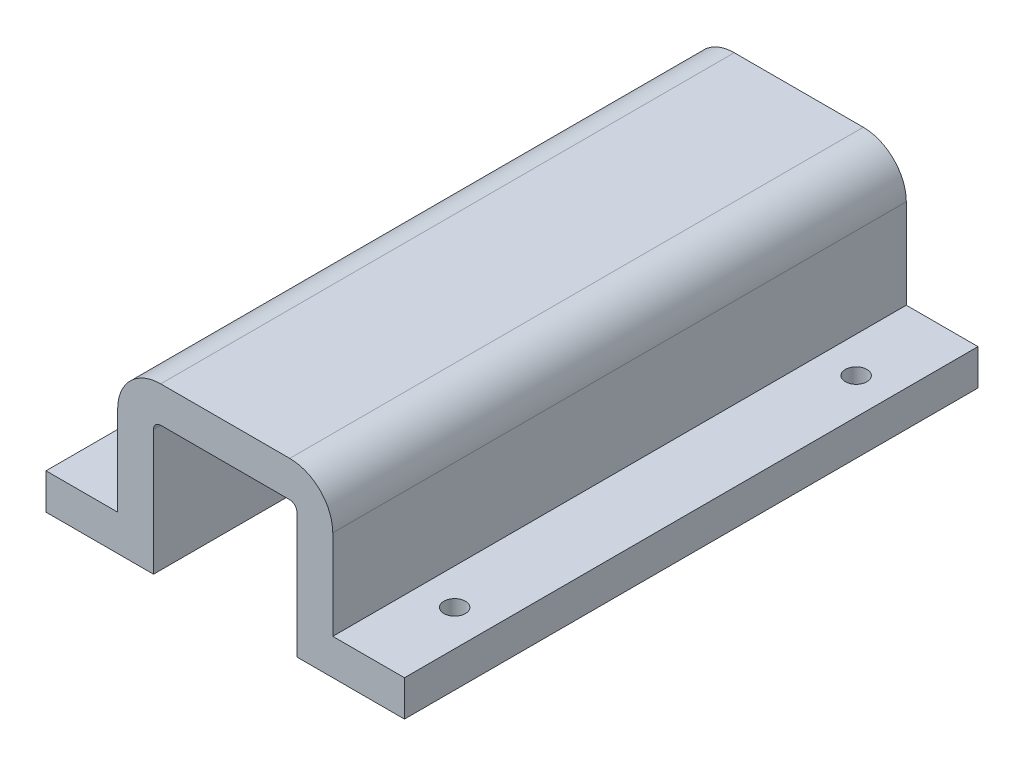
ISO-10303-21;
HEADER;
FILE_DESCRIPTION(('STEP AP214'),'2;1');
FILE_NAME('part.step','',(''),(''),'','','');
FILE_SCHEMA(('AUTOMOTIVE_DESIGN { 1 0 10303 214 1 1 1 1 }'));
ENDSEC;
DATA;
#1=APPLICATION_CONTEXT('core data for automotive mechanical design processes');
#2=APPLICATION_PROTOCOL_DEFINITION('international standard','automotive_design',2000,#1);
#3=PRODUCT_CONTEXT('',#1,'mechanical');
#4=PRODUCT('Part','Part','',(#3));
#5=PRODUCT_RELATED_PRODUCT_CATEGORY('part','',(#4));
#6=PRODUCT_DEFINITION_FORMATION('','',#4);
#7=PRODUCT_DEFINITION_CONTEXT('part definition',#1,'design');
#8=PRODUCT_DEFINITION('design','',#6,#7);
#9=PRODUCT_DEFINITION_SHAPE('','',#8);
#10=(LENGTH_UNIT() NAMED_UNIT(*) SI_UNIT(.MILLI.,.METRE.));
#11=(NAMED_UNIT(*) PLANE_ANGLE_UNIT() SI_UNIT($,.RADIAN.));
#12=(NAMED_UNIT(*) SI_UNIT($,.STERADIAN.) SOLID_ANGLE_UNIT());
#13=UNCERTAINTY_MEASURE_WITH_UNIT(LENGTH_MEASURE(1.E-05),#10,'distance_accuracy_value','');
#14=(GEOMETRIC_REPRESENTATION_CONTEXT(3) GLOBAL_UNCERTAINTY_ASSIGNED_CONTEXT((#13)) GLOBAL_UNIT_ASSIGNED_CONTEXT((#10,
#11,#12)) REPRESENTATION_CONTEXT('',''));
#15=CARTESIAN_POINT('',(0.,0.,0.));
#16=DIRECTION('',(0.,0.,1.));
#17=DIRECTION('',(1.,0.,0.));
#18=AXIS2_PLACEMENT_3D('',#15,#16,#17);
#19=CARTESIAN_POINT('',(9.,9.,80.));
#20=DIRECTION('',(0.,0.,-1.));
#21=DIRECTION('',(-1.,0.,0.));
#22=AXIS2_PLACEMENT_3D('',#19,#20,#21);
#23=CYLINDRICAL_SURFACE('',#22,6.);
#24=CARTESIAN_POINT('',(9.,9.,0.));
#25=DIRECTION('',(0.,0.,1.));
#26=DIRECTION('',(1.,0.,0.));
#27=AXIS2_PLACEMENT_3D('',#24,#25,#26);
#28=CIRCLE('',#27,6.);
#29=CARTESIAN_POINT('',(15.,8.99999999999999,0.));
#30=VERTEX_POINT('',#29);
#31=CARTESIAN_POINT('',(8.99999999999999,15.,0.));
#32=VERTEX_POINT('',#31);
#33=EDGE_CURVE('E182',#30,#32,#28,.T.);
#34=ORIENTED_EDGE('',*,*,#33,.T.);
#35=DIRECTION('',(0.,0.,-1.));
#36=VECTOR('',#35,1.);
#37=CARTESIAN_POINT('',(8.99999999999999,15.,80.));
#38=LINE('',#37,#36);
#39=CARTESIAN_POINT('',(8.99999999999999,15.,80.));
#40=VERTEX_POINT('',#39);
#41=EDGE_CURVE('E11',#40,#32,#38,.T.);
#42=ORIENTED_EDGE('',*,*,#41,.F.);
#43=CARTESIAN_POINT('',(9.,9.,80.));
#44=DIRECTION('',(0.,0.,1.));
#45=DIRECTION('',(1.,0.,0.));
#46=AXIS2_PLACEMENT_3D('',#43,#44,#45);
#47=CIRCLE('',#46,6.);
#48=CARTESIAN_POINT('',(15.,8.99999999999999,80.));
#49=VERTEX_POINT('',#48);
#50=EDGE_CURVE('E213',#49,#40,#47,.T.);
#51=ORIENTED_EDGE('',*,*,#50,.F.);
#52=DIRECTION('',(0.,0.,-1.));
#53=VECTOR('',#52,1.);
#54=CARTESIAN_POINT('',(15.,8.99999999999999,80.));
#55=LINE('',#54,#53);
#56=EDGE_CURVE('E178',#49,#30,#55,.T.);
#57=ORIENTED_EDGE('',*,*,#56,.T.);
#58=EDGE_LOOP('',(#34,#42,#51,#57));
#59=FACE_BOUND('',#58,.T.);
#60=ADVANCED_FACE('F38',(#59),#23,.T.);
#61=CARTESIAN_POINT('',(8.99999999999999,15.,80.));
#62=DIRECTION('',(0.,-1.,0.));
#63=DIRECTION('',(0.,0.,-1.));
#64=AXIS2_PLACEMENT_3D('',#61,#62,#63);
#65=PLANE('',#64);
#66=DIRECTION('',(-1.,0.,0.));
#67=VECTOR('',#66,1.);
#68=CARTESIAN_POINT('',(8.99999999999999,15.,0.));
#69=LINE('',#68,#67);
#70=CARTESIAN_POINT('',(-8.99999999999999,15.,0.));
#71=VERTEX_POINT('',#70);
#72=EDGE_CURVE('E185',#32,#71,#69,.T.);
#73=ORIENTED_EDGE('',*,*,#72,.T.);
#74=DIRECTION('',(0.,0.,-1.));
#75=VECTOR('',#74,1.);
#76=CARTESIAN_POINT('',(-8.99999999999999,15.,80.));
#77=LINE('',#76,#75);
#78=CARTESIAN_POINT('',(-8.99999999999999,15.,80.));
#79=VERTEX_POINT('',#78);
#80=EDGE_CURVE('E46',#79,#71,#77,.T.);
#81=ORIENTED_EDGE('',*,*,#80,.F.);
#82=DIRECTION('',(-1.,0.,0.));
#83=VECTOR('',#82,1.);
#84=CARTESIAN_POINT('',(8.99999999999999,15.,80.));
#85=LINE('',#84,#83);
#86=EDGE_CURVE('E121',#40,#79,#85,.T.);
#87=ORIENTED_EDGE('',*,*,#86,.F.);
#88=ORIENTED_EDGE('',*,*,#41,.T.);
#89=EDGE_LOOP('',(#73,#81,#87,#88));
#90=FACE_BOUND('',#89,.T.);
#91=ADVANCED_FACE('F312',(#90),#65,.F.);
#92=CARTESIAN_POINT('',(-9.,9.,80.));
#93=DIRECTION('',(0.,0.,-1.));
#94=DIRECTION('',(-1.,0.,0.));
#95=AXIS2_PLACEMENT_3D('',#92,#93,#94);
#96=CYLINDRICAL_SURFACE('',#95,6.);
#97=CARTESIAN_POINT('',(-9.,9.,0.));
#98=DIRECTION('',(0.,0.,1.));
#99=DIRECTION('',(1.,0.,0.));
#100=AXIS2_PLACEMENT_3D('',#97,#98,#99);
#101=CIRCLE('',#100,6.);
#102=CARTESIAN_POINT('',(-15.,8.99999999999995,0.));
#103=VERTEX_POINT('',#102);
#104=EDGE_CURVE('E188',#71,#103,#101,.T.);
#105=ORIENTED_EDGE('',*,*,#104,.T.);
#106=DIRECTION('',(0.,0.,-1.));
#107=VECTOR('',#106,1.);
#108=CARTESIAN_POINT('',(-15.,8.99999999999995,80.));
#109=LINE('',#108,#107);
#110=CARTESIAN_POINT('',(-15.,8.99999999999995,80.));
#111=VERTEX_POINT('',#110);
#112=EDGE_CURVE('E244',#111,#103,#109,.T.);
#113=ORIENTED_EDGE('',*,*,#112,.F.);
#114=CARTESIAN_POINT('',(-9.,9.,80.));
#115=DIRECTION('',(0.,0.,1.));
#116=DIRECTION('',(1.,0.,0.));
#117=AXIS2_PLACEMENT_3D('',#114,#115,#116);
#118=CIRCLE('',#117,6.);
#119=EDGE_CURVE('E252',#79,#111,#118,.T.);
#120=ORIENTED_EDGE('',*,*,#119,.F.);
#121=ORIENTED_EDGE('',*,*,#80,.T.);
#122=EDGE_LOOP('',(#105,#113,#120,#121));
#123=FACE_BOUND('',#122,.T.);
#124=ADVANCED_FACE('F250',(#123),#96,.T.);
#125=CARTESIAN_POINT('',(-15.,8.99999999999995,80.));
#126=DIRECTION('',(1.,0.,0.));
#127=DIRECTION('',(0.,1.,0.));
#128=AXIS2_PLACEMENT_3D('',#125,#126,#127);
#129=PLANE('',#128);
#130=DIRECTION('',(0.,-1.,0.));
#131=VECTOR('',#130,1.);
#132=CARTESIAN_POINT('',(-15.,8.99999999999995,0.));
#133=LINE('',#132,#131);
#134=CARTESIAN_POINT('',(-15.,-3.5,0.));
#135=VERTEX_POINT('',#134);
#136=EDGE_CURVE('E190',#103,#135,#133,.T.);
#137=ORIENTED_EDGE('',*,*,#136,.T.);
#138=DIRECTION('',(0.,0.,-1.));
#139=VECTOR('',#138,1.);
#140=CARTESIAN_POINT('',(-15.,-3.5,80.));
#141=LINE('',#140,#139);
#142=CARTESIAN_POINT('',(-15.,-3.5,80.));
#143=VERTEX_POINT('',#142);
#144=EDGE_CURVE('E241',#143,#135,#141,.T.);
#145=ORIENTED_EDGE('',*,*,#144,.F.);
#146=DIRECTION('',(0.,-1.,0.));
#147=VECTOR('',#146,1.);
#148=CARTESIAN_POINT('',(-15.,8.99999999999995,80.));
#149=LINE('',#148,#147);
#150=EDGE_CURVE('E270',#111,#143,#149,.T.);
#151=ORIENTED_EDGE('',*,*,#150,.F.);
#152=ORIENTED_EDGE('',*,*,#112,.T.);
#153=EDGE_LOOP('',(#137,#145,#151,#152));
#154=FACE_BOUND('',#153,.T.);
#155=ADVANCED_FACE('F261',(#154),#129,.F.);
#156=CARTESIAN_POINT('',(-15.,-3.5,80.));
#157=DIRECTION('',(0.,-1.,0.));
#158=DIRECTION('',(1.,0.,0.));
#159=AXIS2_PLACEMENT_3D('',#156,#157,#158);
#160=PLANE('',#159);
#161=CARTESIAN_POINT('',(-20.,-3.5,12.));
#162=DIRECTION('',(0.,1.,0.));
#163=DIRECTION('',(0.,0.,1.));
#164=AXIS2_PLACEMENT_3D('',#161,#162,#163);
#165=CIRCLE('',#164,1.5);
#166=CARTESIAN_POINT('',(-20.,-3.5,13.5));
#167=VERTEX_POINT('',#166);
#168=EDGE_CURVE('E527',#167,#167,#165,.T.);
#169=ORIENTED_EDGE('',*,*,#168,.F.);
#170=EDGE_LOOP('',(#169));
#171=FACE_BOUND('',#170,.T.);
#172=CARTESIAN_POINT('',(-20.,-3.5,68.));
#173=DIRECTION('',(0.,1.,0.));
#174=DIRECTION('',(0.,0.,1.));
#175=AXIS2_PLACEMENT_3D('',#172,#173,#174);
#176=CIRCLE('',#175,1.5);
#177=CARTESIAN_POINT('',(-20.,-3.5,69.5));
#178=VERTEX_POINT('',#177);
#179=EDGE_CURVE('E529',#178,#178,#176,.T.);
#180=ORIENTED_EDGE('',*,*,#179,.F.);
#181=EDGE_LOOP('',(#180));
#182=FACE_BOUND('',#181,.T.);
#183=DIRECTION('',(-1.,0.,0.));
#184=VECTOR('',#183,1.);
#185=CARTESIAN_POINT('',(-15.,-3.5,0.));
#186=LINE('',#185,#184);
#187=CARTESIAN_POINT('',(-25.,-3.50000000000001,0.));
#188=VERTEX_POINT('',#187);
#189=EDGE_CURVE('E192',#135,#188,#186,.T.);
#190=ORIENTED_EDGE('',*,*,#189,.T.);
#191=DIRECTION('',(0.,0.,-1.));
#192=VECTOR('',#191,1.);
#193=CARTESIAN_POINT('',(-25.,-3.50000000000001,80.));
#194=LINE('',#193,#192);
#195=CARTESIAN_POINT('',(-25.,-3.50000000000001,80.));
#196=VERTEX_POINT('',#195);
#197=EDGE_CURVE('E238',#196,#188,#194,.T.);
#198=ORIENTED_EDGE('',*,*,#197,.F.);
#199=DIRECTION('',(-1.,0.,0.));
#200=VECTOR('',#199,1.);
#201=CARTESIAN_POINT('',(-15.,-3.5,80.));
#202=LINE('',#201,#200);
#203=EDGE_CURVE('E267',#143,#196,#202,.T.);
#204=ORIENTED_EDGE('',*,*,#203,.F.);
#205=ORIENTED_EDGE('',*,*,#144,.T.);
#206=EDGE_LOOP('',(#190,#198,#204,#205));
#207=FACE_BOUND('',#206,.T.);
#208=ADVANCED_FACE('F265',(#171,#182,#207),#160,.F.);
#209=CARTESIAN_POINT('',(-25.,-3.50000000000001,80.));
#210=DIRECTION('',(1.,0.,0.));
#211=DIRECTION('',(0.,0.,-1.));
#212=AXIS2_PLACEMENT_3D('',#209,#210,#211);
#213=PLANE('',#212);
#214=DIRECTION('',(0.,-1.,0.));
#215=VECTOR('',#214,1.);
#216=CARTESIAN_POINT('',(-25.,-3.50000000000001,0.));
#217=LINE('',#216,#215);
#218=CARTESIAN_POINT('',(-25.,-8.5,0.));
#219=VERTEX_POINT('',#218);
#220=EDGE_CURVE('E194',#188,#219,#217,.T.);
#221=ORIENTED_EDGE('',*,*,#220,.T.);
#222=DIRECTION('',(0.,0.,-1.));
#223=VECTOR('',#222,1.);
#224=CARTESIAN_POINT('',(-25.,-8.5,80.));
#225=LINE('',#224,#223);
#226=CARTESIAN_POINT('',(-25.,-8.5,80.));
#227=VERTEX_POINT('',#226);
#228=EDGE_CURVE('E235',#227,#219,#225,.T.);
#229=ORIENTED_EDGE('',*,*,#228,.F.);
#230=DIRECTION('',(0.,-1.,0.));
#231=VECTOR('',#230,1.);
#232=CARTESIAN_POINT('',(-25.,-3.50000000000001,80.));
#233=LINE('',#232,#231);
#234=EDGE_CURVE('E269',#196,#227,#233,.T.);
#235=ORIENTED_EDGE('',*,*,#234,.F.);
#236=ORIENTED_EDGE('',*,*,#197,.T.);
#237=EDGE_LOOP('',(#221,#229,#235,#236));
#238=FACE_BOUND('',#237,.T.);
#239=ADVANCED_FACE('F325',(#238),#213,.F.);
#240=CARTESIAN_POINT('',(-25.,-8.5,80.));
#241=DIRECTION('',(0.,1.,0.));
#242=DIRECTION('',(-1.,0.,0.));
#243=AXIS2_PLACEMENT_3D('',#240,#241,#242);
#244=PLANE('',#243);
#245=CARTESIAN_POINT('',(-20.,-8.50000000000001,12.));
#246=DIRECTION('',(0.,1.,0.));
#247=DIRECTION('',(0.,0.,1.));
#248=AXIS2_PLACEMENT_3D('',#245,#246,#247);
#249=CIRCLE('',#248,1.5);
#250=CARTESIAN_POINT('',(-20.,-8.50000000000001,13.5));
#251=VERTEX_POINT('',#250);
#252=EDGE_CURVE('E524',#251,#251,#249,.T.);
#253=ORIENTED_EDGE('',*,*,#252,.T.);
#254=EDGE_LOOP('',(#253));
#255=FACE_BOUND('',#254,.T.);
#256=CARTESIAN_POINT('',(-20.,-8.50000000000001,68.));
#257=DIRECTION('',(0.,1.,0.));
#258=DIRECTION('',(0.,0.,1.));
#259=AXIS2_PLACEMENT_3D('',#256,#257,#258);
#260=CIRCLE('',#259,1.5);
#261=CARTESIAN_POINT('',(-20.,-8.50000000000001,69.5));
#262=VERTEX_POINT('',#261);
#263=EDGE_CURVE('E534',#262,#262,#260,.T.);
#264=ORIENTED_EDGE('',*,*,#263,.T.);
#265=EDGE_LOOP('',(#264));
#266=FACE_BOUND('',#265,.T.);
#267=DIRECTION('',(1.,0.,0.));
#268=VECTOR('',#267,1.);
#269=CARTESIAN_POINT('',(-25.,-8.5,0.));
#270=LINE('',#269,#268);
#271=CARTESIAN_POINT('',(-10.,-8.5,0.));
#272=VERTEX_POINT('',#271);
#273=EDGE_CURVE('E196',#219,#272,#270,.T.);
#274=ORIENTED_EDGE('',*,*,#273,.T.);
#275=DIRECTION('',(0.,0.,-1.));
#276=VECTOR('',#275,1.);
#277=CARTESIAN_POINT('',(-10.,-8.5,80.));
#278=LINE('',#277,#276);
#279=CARTESIAN_POINT('',(-10.,-8.5,80.));
#280=VERTEX_POINT('',#279);
#281=EDGE_CURVE('E232',#280,#272,#278,.T.);
#282=ORIENTED_EDGE('',*,*,#281,.F.);
#283=DIRECTION('',(1.,0.,0.));
#284=VECTOR('',#283,1.);
#285=CARTESIAN_POINT('',(-25.,-8.5,80.));
#286=LINE('',#285,#284);
#287=EDGE_CURVE('E272',#227,#280,#286,.T.);
#288=ORIENTED_EDGE('',*,*,#287,.F.);
#289=ORIENTED_EDGE('',*,*,#228,.T.);
#290=EDGE_LOOP('',(#274,#282,#288,#289));
#291=FACE_BOUND('',#290,.T.);
#292=ADVANCED_FACE('F329',(#255,#266,#291),#244,.F.);
#293=CARTESIAN_POINT('',(-10.,8.99999999999999,80.));
#294=DIRECTION('',(-1.,0.,0.));
#295=DIRECTION('',(0.,-1.,0.));
#296=AXIS2_PLACEMENT_3D('',#293,#294,#295);
#297=PLANE('',#296);
#298=DIRECTION('',(0.,1.,0.));
#299=VECTOR('',#298,1.);
#300=CARTESIAN_POINT('',(-10.,8.99999999999999,0.));
#301=LINE('',#300,#299);
#302=CARTESIAN_POINT('',(-10.,8.99999999999999,0.));
#303=VERTEX_POINT('',#302);
#304=EDGE_CURVE('E198',#272,#303,#301,.T.);
#305=ORIENTED_EDGE('',*,*,#304,.T.);
#306=DIRECTION('',(0.,0.,-1.));
#307=VECTOR('',#306,1.);
#308=CARTESIAN_POINT('',(-10.,8.99999999999999,80.));
#309=LINE('',#308,#307);
#310=CARTESIAN_POINT('',(-10.,8.99999999999999,80.));
#311=VERTEX_POINT('',#310);
#312=EDGE_CURVE('E229',#311,#303,#309,.T.);
#313=ORIENTED_EDGE('',*,*,#312,.F.);
#314=DIRECTION('',(0.,1.,0.));
#315=VECTOR('',#314,1.);
#316=CARTESIAN_POINT('',(-10.,8.99999999999999,80.));
#317=LINE('',#316,#315);
#318=EDGE_CURVE('E278',#280,#311,#317,.T.);
#319=ORIENTED_EDGE('',*,*,#318,.F.);
#320=ORIENTED_EDGE('',*,*,#281,.T.);
#321=EDGE_LOOP('',(#305,#313,#319,#320));
#322=FACE_BOUND('',#321,.T.);
#323=ADVANCED_FACE('F333',(#322),#297,.F.);
#324=CARTESIAN_POINT('',(-9.,9.,80.));
#325=DIRECTION('',(0.,0.,-1.));
#326=DIRECTION('',(-1.,0.,0.));
#327=AXIS2_PLACEMENT_3D('',#324,#325,#326);
#328=CYLINDRICAL_SURFACE('',#327,0.999999999999999);
#329=CARTESIAN_POINT('',(-9.,9.,0.));
#330=DIRECTION('',(0.,0.,-1.));
#331=DIRECTION('',(1.,0.,0.));
#332=AXIS2_PLACEMENT_3D('',#329,#330,#331);
#333=CIRCLE('',#332,0.999999999999999);
#334=CARTESIAN_POINT('',(-8.99999999999999,10.,0.));
#335=VERTEX_POINT('',#334);
#336=EDGE_CURVE('E200',#303,#335,#333,.T.);
#337=ORIENTED_EDGE('',*,*,#336,.T.);
#338=DIRECTION('',(0.,0.,-1.));
#339=VECTOR('',#338,1.);
#340=CARTESIAN_POINT('',(-8.99999999999999,10.,80.));
#341=LINE('',#340,#339);
#342=CARTESIAN_POINT('',(-8.99999999999999,10.,80.));
#343=VERTEX_POINT('',#342);
#344=EDGE_CURVE('E226',#343,#335,#341,.T.);
#345=ORIENTED_EDGE('',*,*,#344,.F.);
#346=CARTESIAN_POINT('',(-9.,9.,80.));
#347=DIRECTION('',(0.,0.,-1.));
#348=DIRECTION('',(1.,0.,0.));
#349=AXIS2_PLACEMENT_3D('',#346,#347,#348);
#350=CIRCLE('',#349,0.999999999999999);
#351=EDGE_CURVE('E280',#311,#343,#350,.T.);
#352=ORIENTED_EDGE('',*,*,#351,.F.);
#353=ORIENTED_EDGE('',*,*,#312,.T.);
#354=EDGE_LOOP('',(#337,#345,#352,#353));
#355=FACE_BOUND('',#354,.T.);
#356=ADVANCED_FACE('F337',(#355),#328,.F.);
#357=CARTESIAN_POINT('',(8.99999999999999,10.,80.));
#358=DIRECTION('',(0.,1.,0.));
#359=DIRECTION('',(-1.,0.,0.));
#360=AXIS2_PLACEMENT_3D('',#357,#358,#359);
#361=PLANE('',#360);
#362=DIRECTION('',(1.,0.,0.));
#363=VECTOR('',#362,1.);
#364=CARTESIAN_POINT('',(8.99999999999999,10.,0.));
#365=LINE('',#364,#363);
#366=CARTESIAN_POINT('',(8.99999999999999,10.,0.));
#367=VERTEX_POINT('',#366);
#368=EDGE_CURVE('E202',#335,#367,#365,.T.);
#369=ORIENTED_EDGE('',*,*,#368,.T.);
#370=DIRECTION('',(0.,0.,-1.));
#371=VECTOR('',#370,1.);
#372=CARTESIAN_POINT('',(8.99999999999999,10.,80.));
#373=LINE('',#372,#371);
#374=CARTESIAN_POINT('',(8.99999999999999,10.,80.));
#375=VERTEX_POINT('',#374);
#376=EDGE_CURVE('E223',#375,#367,#373,.T.);
#377=ORIENTED_EDGE('',*,*,#376,.F.);
#378=DIRECTION('',(1.,0.,0.));
#379=VECTOR('',#378,1.);
#380=CARTESIAN_POINT('',(8.99999999999999,10.,80.));
#381=LINE('',#380,#379);
#382=EDGE_CURVE('E282',#343,#375,#381,.T.);
#383=ORIENTED_EDGE('',*,*,#382,.F.);
#384=ORIENTED_EDGE('',*,*,#344,.T.);
#385=EDGE_LOOP('',(#369,#377,#383,#384));
#386=FACE_BOUND('',#385,.T.);
#387=ADVANCED_FACE('F341',(#386),#361,.F.);
#388=CARTESIAN_POINT('',(9.,9.,80.));
#389=DIRECTION('',(0.,0.,-1.));
#390=DIRECTION('',(-1.,0.,0.));
#391=AXIS2_PLACEMENT_3D('',#388,#389,#390);
#392=CYLINDRICAL_SURFACE('',#391,0.999999999999999);
#393=CARTESIAN_POINT('',(9.,9.,0.));
#394=DIRECTION('',(0.,0.,-1.));
#395=DIRECTION('',(1.,0.,0.));
#396=AXIS2_PLACEMENT_3D('',#393,#394,#395);
#397=CIRCLE('',#396,0.999999999999999);
#398=CARTESIAN_POINT('',(10.,8.99999999999999,0.));
#399=VERTEX_POINT('',#398);
#400=EDGE_CURVE('E204',#367,#399,#397,.T.);
#401=ORIENTED_EDGE('',*,*,#400,.T.);
#402=DIRECTION('',(0.,0.,-1.));
#403=VECTOR('',#402,1.);
#404=CARTESIAN_POINT('',(10.,8.99999999999999,80.));
#405=LINE('',#404,#403);
#406=CARTESIAN_POINT('',(10.,8.99999999999999,80.));
#407=VERTEX_POINT('',#406);
#408=EDGE_CURVE('E220',#407,#399,#405,.T.);
#409=ORIENTED_EDGE('',*,*,#408,.F.);
#410=CARTESIAN_POINT('',(9.,9.,80.));
#411=DIRECTION('',(0.,0.,-1.));
#412=DIRECTION('',(1.,0.,0.));
#413=AXIS2_PLACEMENT_3D('',#410,#411,#412);
#414=CIRCLE('',#413,0.999999999999999);
#415=EDGE_CURVE('E284',#375,#407,#414,.T.);
#416=ORIENTED_EDGE('',*,*,#415,.F.);
#417=ORIENTED_EDGE('',*,*,#376,.T.);
#418=EDGE_LOOP('',(#401,#409,#416,#417));
#419=FACE_BOUND('',#418,.T.);
#420=ADVANCED_FACE('F345',(#419),#392,.F.);
#421=CARTESIAN_POINT('',(10.,8.99999999999999,80.));
#422=DIRECTION('',(1.,0.,0.));
#423=DIRECTION('',(0.,0.,-1.));
#424=AXIS2_PLACEMENT_3D('',#421,#422,#423);
#425=PLANE('',#424);
#426=DIRECTION('',(0.,-1.,0.));
#427=VECTOR('',#426,1.);
#428=CARTESIAN_POINT('',(10.,8.99999999999999,0.));
#429=LINE('',#428,#427);
#430=CARTESIAN_POINT('',(10.,-8.5,0.));
#431=VERTEX_POINT('',#430);
#432=EDGE_CURVE('E206',#399,#431,#429,.T.);
#433=ORIENTED_EDGE('',*,*,#432,.T.);
#434=DIRECTION('',(0.,0.,-1.));
#435=VECTOR('',#434,1.);
#436=CARTESIAN_POINT('',(10.,-8.5,80.));
#437=LINE('',#436,#435);
#438=CARTESIAN_POINT('',(10.,-8.5,80.));
#439=VERTEX_POINT('',#438);
#440=EDGE_CURVE('E217',#439,#431,#437,.T.);
#441=ORIENTED_EDGE('',*,*,#440,.F.);
#442=DIRECTION('',(0.,-1.,0.));
#443=VECTOR('',#442,1.);
#444=CARTESIAN_POINT('',(10.,8.99999999999999,80.));
#445=LINE('',#444,#443);
#446=EDGE_CURVE('E286',#407,#439,#445,.T.);
#447=ORIENTED_EDGE('',*,*,#446,.F.);
#448=ORIENTED_EDGE('',*,*,#408,.T.);
#449=EDGE_LOOP('',(#433,#441,#447,#448));
#450=FACE_BOUND('',#449,.T.);
#451=ADVANCED_FACE('F292',(#450),#425,.F.);
#452=CARTESIAN_POINT('',(10.,-8.5,80.));
#453=DIRECTION('',(0.,1.,0.));
#454=DIRECTION('',(-1.,0.,0.));
#455=AXIS2_PLACEMENT_3D('',#452,#453,#454);
#456=PLANE('',#455);
#457=CARTESIAN_POINT('',(20.,-8.5,12.));
#458=DIRECTION('',(0.,1.,0.));
#459=DIRECTION('',(0.,0.,1.));
#460=AXIS2_PLACEMENT_3D('',#457,#458,#459);
#461=CIRCLE('',#460,1.5);
#462=CARTESIAN_POINT('',(20.,-8.5,13.5));
#463=VERTEX_POINT('',#462);
#464=EDGE_CURVE('E540',#463,#463,#461,.T.);
#465=ORIENTED_EDGE('',*,*,#464,.T.);
#466=EDGE_LOOP('',(#465));
#467=FACE_BOUND('',#466,.T.);
#468=CARTESIAN_POINT('',(20.,-8.5,68.));
#469=DIRECTION('',(0.,1.,0.));
#470=DIRECTION('',(0.,0.,1.));
#471=AXIS2_PLACEMENT_3D('',#468,#469,#470);
#472=CIRCLE('',#471,1.5);
#473=CARTESIAN_POINT('',(20.,-8.5,69.5));
#474=VERTEX_POINT('',#473);
#475=EDGE_CURVE('E186',#474,#474,#472,.T.);
#476=ORIENTED_EDGE('',*,*,#475,.T.);
#477=EDGE_LOOP('',(#476));
#478=FACE_BOUND('',#477,.T.);
#479=DIRECTION('',(1.,0.,0.));
#480=VECTOR('',#479,1.);
#481=CARTESIAN_POINT('',(10.,-8.5,0.));
#482=LINE('',#481,#480);
#483=CARTESIAN_POINT('',(25.,-8.5,0.));
#484=VERTEX_POINT('',#483);
#485=EDGE_CURVE('E208',#431,#484,#482,.T.);
#486=ORIENTED_EDGE('',*,*,#485,.T.);
#487=DIRECTION('',(0.,0.,-1.));
#488=VECTOR('',#487,1.);
#489=CARTESIAN_POINT('',(25.,-8.5,80.));
#490=LINE('',#489,#488);
#491=CARTESIAN_POINT('',(25.,-8.5,80.));
#492=VERTEX_POINT('',#491);
#493=EDGE_CURVE('E173',#492,#484,#490,.T.);
#494=ORIENTED_EDGE('',*,*,#493,.F.);
#495=DIRECTION('',(1.,0.,0.));
#496=VECTOR('',#495,1.);
#497=CARTESIAN_POINT('',(10.,-8.5,80.));
#498=LINE('',#497,#496);
#499=EDGE_CURVE('E164',#439,#492,#498,.T.);
#500=ORIENTED_EDGE('',*,*,#499,.F.);
#501=ORIENTED_EDGE('',*,*,#440,.T.);
#502=EDGE_LOOP('',(#486,#494,#500,#501));
#503=FACE_BOUND('',#502,.T.);
#504=ADVANCED_FACE('F296',(#467,#478,#503),#456,.F.);
#505=CARTESIAN_POINT('',(25.,-8.5,80.));
#506=DIRECTION('',(-1.,0.,0.));
#507=DIRECTION('',(0.,-1.,0.));
#508=AXIS2_PLACEMENT_3D('',#505,#506,#507);
#509=PLANE('',#508);
#510=DIRECTION('',(0.,1.,0.));
#511=VECTOR('',#510,1.);
#512=CARTESIAN_POINT('',(25.,-8.5,0.));
#513=LINE('',#512,#511);
#514=CARTESIAN_POINT('',(25.,-3.5,0.));
#515=VERTEX_POINT('',#514);
#516=EDGE_CURVE('E172',#484,#515,#513,.T.);
#517=ORIENTED_EDGE('',*,*,#516,.T.);
#518=DIRECTION('',(0.,0.,-1.));
#519=VECTOR('',#518,1.);
#520=CARTESIAN_POINT('',(25.,-3.5,80.));
#521=LINE('',#520,#519);
#522=CARTESIAN_POINT('',(25.,-3.5,80.));
#523=VERTEX_POINT('',#522);
#524=EDGE_CURVE('E169',#523,#515,#521,.T.);
#525=ORIENTED_EDGE('',*,*,#524,.F.);
#526=DIRECTION('',(0.,1.,0.));
#527=VECTOR('',#526,1.);
#528=CARTESIAN_POINT('',(25.,-8.5,80.));
#529=LINE('',#528,#527);
#530=EDGE_CURVE('E158',#492,#523,#529,.T.);
#531=ORIENTED_EDGE('',*,*,#530,.F.);
#532=ORIENTED_EDGE('',*,*,#493,.T.);
#533=EDGE_LOOP('',(#517,#525,#531,#532));
#534=FACE_BOUND('',#533,.T.);
#535=ADVANCED_FACE('F170',(#534),#509,.F.);
#536=CARTESIAN_POINT('',(25.,-3.5,80.));
#537=DIRECTION('',(0.,-1.,0.));
#538=DIRECTION('',(1.,0.,0.));
#539=AXIS2_PLACEMENT_3D('',#536,#537,#538);
#540=PLANE('',#539);
#541=CARTESIAN_POINT('',(20.,-3.5,12.));
#542=DIRECTION('',(0.,1.,0.));
#543=DIRECTION('',(0.,0.,1.));
#544=AXIS2_PLACEMENT_3D('',#541,#542,#543);
#545=CIRCLE('',#544,1.5);
#546=CARTESIAN_POINT('',(20.,-3.5,13.5));
#547=VERTEX_POINT('',#546);
#548=EDGE_CURVE('E537',#547,#547,#545,.T.);
#549=ORIENTED_EDGE('',*,*,#548,.F.);
#550=EDGE_LOOP('',(#549));
#551=FACE_BOUND('',#550,.T.);
#552=CARTESIAN_POINT('',(20.,-3.5,68.));
#553=DIRECTION('',(0.,1.,0.));
#554=DIRECTION('',(0.,0.,1.));
#555=AXIS2_PLACEMENT_3D('',#552,#553,#554);
#556=CIRCLE('',#555,1.5);
#557=CARTESIAN_POINT('',(20.,-3.5,69.5));
#558=VERTEX_POINT('',#557);
#559=EDGE_CURVE('E543',#558,#558,#556,.T.);
#560=ORIENTED_EDGE('',*,*,#559,.F.);
#561=EDGE_LOOP('',(#560));
#562=FACE_BOUND('',#561,.T.);
#563=DIRECTION('',(-1.,0.,0.));
#564=VECTOR('',#563,1.);
#565=CARTESIAN_POINT('',(25.,-3.5,0.));
#566=LINE('',#565,#564);
#567=CARTESIAN_POINT('',(15.,-3.5,0.));
#568=VERTEX_POINT('',#567);
#569=EDGE_CURVE('E107',#515,#568,#566,.T.);
#570=ORIENTED_EDGE('',*,*,#569,.T.);
#571=DIRECTION('',(0.,0.,-1.));
#572=VECTOR('',#571,1.);
#573=CARTESIAN_POINT('',(15.,-3.5,80.));
#574=LINE('',#573,#572);
#575=CARTESIAN_POINT('',(15.,-3.5,80.));
#576=VERTEX_POINT('',#575);
#577=EDGE_CURVE('E174',#576,#568,#574,.T.);
#578=ORIENTED_EDGE('',*,*,#577,.F.);
#579=DIRECTION('',(-1.,0.,0.));
#580=VECTOR('',#579,1.);
#581=CARTESIAN_POINT('',(25.,-3.5,80.));
#582=LINE('',#581,#580);
#583=EDGE_CURVE('E162',#523,#576,#582,.T.);
#584=ORIENTED_EDGE('',*,*,#583,.F.);
#585=ORIENTED_EDGE('',*,*,#524,.T.);
#586=EDGE_LOOP('',(#570,#578,#584,#585));
#587=FACE_BOUND('',#586,.T.);
#588=ADVANCED_FACE('F176',(#551,#562,#587),#540,.F.);
#589=CARTESIAN_POINT('',(15.,-3.5,80.));
#590=DIRECTION('',(-1.,0.,0.));
#591=DIRECTION('',(0.,-1.,0.));
#592=AXIS2_PLACEMENT_3D('',#589,#590,#591);
#593=PLANE('',#592);
#594=DIRECTION('',(0.,1.,0.));
#595=VECTOR('',#594,1.);
#596=CARTESIAN_POINT('',(15.,-3.5,0.));
#597=LINE('',#596,#595);
#598=EDGE_CURVE('E113',#568,#30,#597,.T.);
#599=ORIENTED_EDGE('',*,*,#598,.T.);
#600=ORIENTED_EDGE('',*,*,#56,.F.);
#601=DIRECTION('',(0.,1.,0.));
#602=VECTOR('',#601,1.);
#603=CARTESIAN_POINT('',(15.,-3.5,80.));
#604=LINE('',#603,#602);
#605=EDGE_CURVE('E54',#576,#49,#604,.T.);
#606=ORIENTED_EDGE('',*,*,#605,.F.);
#607=ORIENTED_EDGE('',*,*,#577,.T.);
#608=EDGE_LOOP('',(#599,#600,#606,#607));
#609=FACE_BOUND('',#608,.T.);
#610=ADVANCED_FACE('F300',(#609),#593,.F.);
#611=CARTESIAN_POINT('',(9.,9.,80.));
#612=DIRECTION('',(0.,0.,1.));
#613=DIRECTION('',(1.,0.,0.));
#614=AXIS2_PLACEMENT_3D('',#611,#612,#613);
#615=PLANE('',#614);
#616=ORIENTED_EDGE('',*,*,#50,.T.);
#617=ORIENTED_EDGE('',*,*,#86,.T.);
#618=ORIENTED_EDGE('',*,*,#119,.T.);
#619=ORIENTED_EDGE('',*,*,#150,.T.);
#620=ORIENTED_EDGE('',*,*,#203,.T.);
#621=ORIENTED_EDGE('',*,*,#234,.T.);
#622=ORIENTED_EDGE('',*,*,#287,.T.);
#623=ORIENTED_EDGE('',*,*,#318,.T.);
#624=ORIENTED_EDGE('',*,*,#351,.T.);
#625=ORIENTED_EDGE('',*,*,#382,.T.);
#626=ORIENTED_EDGE('',*,*,#415,.T.);
#627=ORIENTED_EDGE('',*,*,#446,.T.);
#628=ORIENTED_EDGE('',*,*,#499,.T.);
#629=ORIENTED_EDGE('',*,*,#530,.T.);
#630=ORIENTED_EDGE('',*,*,#583,.T.);
#631=ORIENTED_EDGE('',*,*,#605,.T.);
#632=EDGE_LOOP('',(#616,#617,#618,#619,#620,#621,#622,#623,#624,#625,#626,#627,#628,#629,#630,#631));
#633=FACE_BOUND('',#632,.T.);
#634=ADVANCED_FACE('F160',(#633),#615,.T.);
#635=CARTESIAN_POINT('',(9.,9.,0.));
#636=DIRECTION('',(0.,0.,1.));
#637=DIRECTION('',(1.,0.,0.));
#638=AXIS2_PLACEMENT_3D('',#635,#636,#637);
#639=PLANE('',#638);
#640=ORIENTED_EDGE('',*,*,#33,.F.);
#641=ORIENTED_EDGE('',*,*,#598,.F.);
#642=ORIENTED_EDGE('',*,*,#569,.F.);
#643=ORIENTED_EDGE('',*,*,#516,.F.);
#644=ORIENTED_EDGE('',*,*,#485,.F.);
#645=ORIENTED_EDGE('',*,*,#432,.F.);
#646=ORIENTED_EDGE('',*,*,#400,.F.);
#647=ORIENTED_EDGE('',*,*,#368,.F.);
#648=ORIENTED_EDGE('',*,*,#336,.F.);
#649=ORIENTED_EDGE('',*,*,#304,.F.);
#650=ORIENTED_EDGE('',*,*,#273,.F.);
#651=ORIENTED_EDGE('',*,*,#220,.F.);
#652=ORIENTED_EDGE('',*,*,#189,.F.);
#653=ORIENTED_EDGE('',*,*,#136,.F.);
#654=ORIENTED_EDGE('',*,*,#104,.F.);
#655=ORIENTED_EDGE('',*,*,#72,.F.);
#656=EDGE_LOOP('',(#640,#641,#642,#643,#644,#645,#646,#647,#648,#649,#650,#651,#652,#653,#654,#655));
#657=FACE_BOUND('',#656,.T.);
#658=ADVANCED_FACE('F256',(#657),#639,.F.);
#659=CARTESIAN_POINT('',(20.,-3.5,68.));
#660=DIRECTION('',(0.,1.,0.));
#661=DIRECTION('',(0.,0.,1.));
#662=AXIS2_PLACEMENT_3D('',#659,#660,#661);
#663=CYLINDRICAL_SURFACE('',#662,1.5);
#664=ORIENTED_EDGE('',*,*,#475,.F.);
#665=EDGE_LOOP('',(#664));
#666=FACE_BOUND('',#665,.T.);
#667=ORIENTED_EDGE('',*,*,#559,.T.);
#668=EDGE_LOOP('',(#667));
#669=FACE_BOUND('',#668,.T.);
#670=ADVANCED_FACE('F374',(#666,#669),#663,.F.);
#671=CARTESIAN_POINT('',(20.,-3.5,12.));
#672=DIRECTION('',(0.,1.,0.));
#673=DIRECTION('',(0.,0.,1.));
#674=AXIS2_PLACEMENT_3D('',#671,#672,#673);
#675=CYLINDRICAL_SURFACE('',#674,1.5);
#676=ORIENTED_EDGE('',*,*,#464,.F.);
#677=EDGE_LOOP('',(#676));
#678=FACE_BOUND('',#677,.T.);
#679=ORIENTED_EDGE('',*,*,#548,.T.);
#680=EDGE_LOOP('',(#679));
#681=FACE_BOUND('',#680,.T.);
#682=ADVANCED_FACE('F379',(#678,#681),#675,.F.);
#683=CARTESIAN_POINT('',(-20.,-3.5,68.));
#684=DIRECTION('',(0.,1.,0.));
#685=DIRECTION('',(0.,0.,1.));
#686=AXIS2_PLACEMENT_3D('',#683,#684,#685);
#687=CYLINDRICAL_SURFACE('',#686,1.5);
#688=ORIENTED_EDGE('',*,*,#263,.F.);
#689=EDGE_LOOP('',(#688));
#690=FACE_BOUND('',#689,.T.);
#691=ORIENTED_EDGE('',*,*,#179,.T.);
#692=EDGE_LOOP('',(#691));
#693=FACE_BOUND('',#692,.T.);
#694=ADVANCED_FACE('F391',(#690,#693),#687,.F.);
#695=CARTESIAN_POINT('',(-20.,-3.5,12.));
#696=DIRECTION('',(0.,1.,0.));
#697=DIRECTION('',(0.,0.,1.));
#698=AXIS2_PLACEMENT_3D('',#695,#696,#697);
#699=CYLINDRICAL_SURFACE('',#698,1.5);
#700=ORIENTED_EDGE('',*,*,#252,.F.);
#701=EDGE_LOOP('',(#700));
#702=FACE_BOUND('',#701,.T.);
#703=ORIENTED_EDGE('',*,*,#168,.T.);
#704=EDGE_LOOP('',(#703));
#705=FACE_BOUND('',#704,.T.);
#706=ADVANCED_FACE('F401',(#702,#705),#699,.F.);
#707=CLOSED_SHELL('',(#60,#91,#124,#155,#208,#239,#292,#323,#356,#387,#420,#451,#504,#535,#588,
#610,#634,#658,#670,#682,#694,#706));
#708=MANIFOLD_SOLID_BREP('B2',#707);
#709=ADVANCED_BREP_SHAPE_REPRESENTATION('',(#18,#708),#14);
#710=SHAPE_DEFINITION_REPRESENTATION(#9,#709);
ENDSEC;
END-ISO-10303-21;
